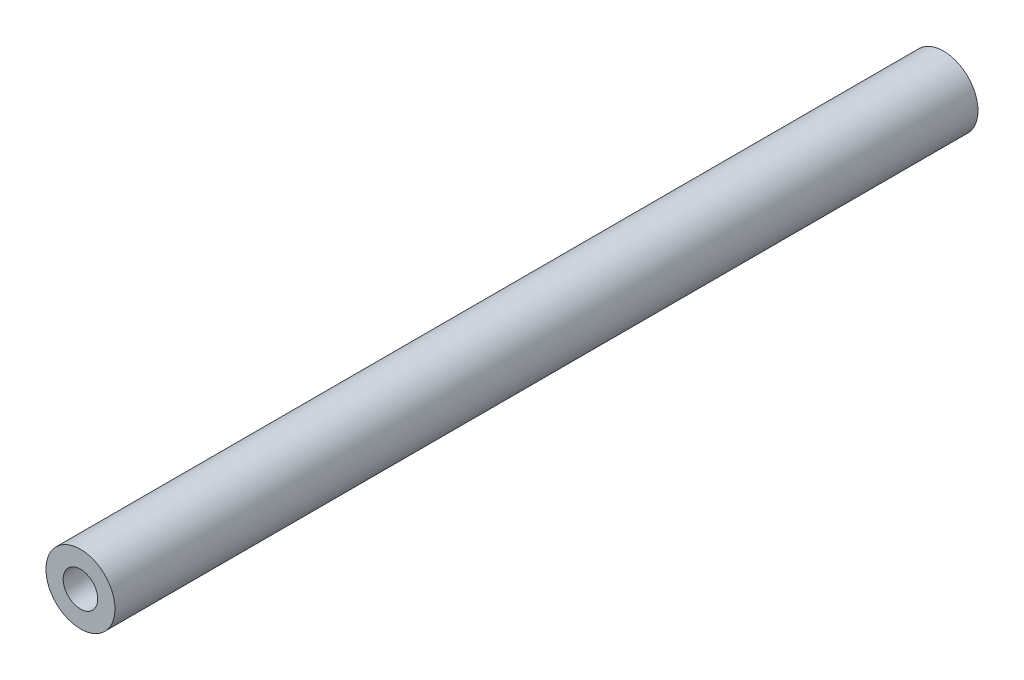
ISO-10303-21;
HEADER;
FILE_DESCRIPTION(('STEP AP214'),'2;1');
FILE_NAME('part.step','',(''),(''),'','','');
FILE_SCHEMA(('AUTOMOTIVE_DESIGN { 1 0 10303 214 1 1 1 1 }'));
ENDSEC;
DATA;
#1=APPLICATION_CONTEXT('core data for automotive mechanical design processes');
#2=APPLICATION_PROTOCOL_DEFINITION('international standard','automotive_design',2000,#1);
#3=PRODUCT_CONTEXT('',#1,'mechanical');
#4=PRODUCT('Part','Part','',(#3));
#5=PRODUCT_RELATED_PRODUCT_CATEGORY('part','',(#4));
#6=PRODUCT_DEFINITION_FORMATION('','',#4);
#7=PRODUCT_DEFINITION_CONTEXT('part definition',#1,'design');
#8=PRODUCT_DEFINITION('design','',#6,#7);
#9=PRODUCT_DEFINITION_SHAPE('','',#8);
#10=(LENGTH_UNIT() NAMED_UNIT(*) SI_UNIT(.MILLI.,.METRE.));
#11=(NAMED_UNIT(*) PLANE_ANGLE_UNIT() SI_UNIT($,.RADIAN.));
#12=(NAMED_UNIT(*) SI_UNIT($,.STERADIAN.) SOLID_ANGLE_UNIT());
#13=UNCERTAINTY_MEASURE_WITH_UNIT(LENGTH_MEASURE(1.E-05),#10,'distance_accuracy_value','');
#14=(GEOMETRIC_REPRESENTATION_CONTEXT(3) GLOBAL_UNCERTAINTY_ASSIGNED_CONTEXT((#13)) GLOBAL_UNIT_ASSIGNED_CONTEXT((#10,
#11,#12)) REPRESENTATION_CONTEXT('',''));
#15=CARTESIAN_POINT('',(0.,0.,0.));
#16=DIRECTION('',(0.,0.,1.));
#17=DIRECTION('',(1.,0.,0.));
#18=AXIS2_PLACEMENT_3D('',#15,#16,#17);
#19=CARTESIAN_POINT('',(0.,0.,50.));
#20=DIRECTION('',(0.,0.,1.));
#21=DIRECTION('',(1.,0.,0.));
#22=AXIS2_PLACEMENT_3D('',#19,#20,#21);
#23=PLANE('',#22);
#24=CARTESIAN_POINT('',(0.,0.,50.));
#25=DIRECTION('',(0.,0.,1.));
#26=DIRECTION('',(1.,0.,0.));
#27=AXIS2_PLACEMENT_3D('',#24,#25,#26);
#28=CIRCLE('',#27,2.);
#29=CARTESIAN_POINT('',(2.,0.,50.));
#30=VERTEX_POINT('',#29);
#31=EDGE_CURVE('E10',#30,#30,#28,.T.);
#32=ORIENTED_EDGE('',*,*,#31,.T.);
#33=EDGE_LOOP('',(#32));
#34=FACE_BOUND('',#33,.T.);
#35=CARTESIAN_POINT('',(0.,0.,50.));
#36=DIRECTION('',(0.,0.,1.));
#37=DIRECTION('',(1.,0.,0.));
#38=AXIS2_PLACEMENT_3D('',#35,#36,#37);
#39=CIRCLE('',#38,1.);
#40=CARTESIAN_POINT('',(1.,0.,50.));
#41=VERTEX_POINT('',#40);
#42=EDGE_CURVE('E54',#41,#41,#39,.T.);
#43=ORIENTED_EDGE('',*,*,#42,.F.);
#44=EDGE_LOOP('',(#43));
#45=FACE_BOUND('',#44,.T.);
#46=ADVANCED_FACE('F41',(#34,#45),#23,.T.);
#47=CARTESIAN_POINT('',(0.,0.,0.));
#48=DIRECTION('',(0.,0.,1.));
#49=DIRECTION('',(1.,0.,0.));
#50=AXIS2_PLACEMENT_3D('',#47,#48,#49);
#51=PLANE('',#50);
#52=CARTESIAN_POINT('',(0.,0.,0.));
#53=DIRECTION('',(0.,0.,1.));
#54=DIRECTION('',(1.,0.,0.));
#55=AXIS2_PLACEMENT_3D('',#52,#53,#54);
#56=CIRCLE('',#55,2.);
#57=CARTESIAN_POINT('',(2.,0.,0.));
#58=VERTEX_POINT('',#57);
#59=EDGE_CURVE('E45',#58,#58,#56,.T.);
#60=ORIENTED_EDGE('',*,*,#59,.F.);
#61=EDGE_LOOP('',(#60));
#62=FACE_BOUND('',#61,.T.);
#63=CARTESIAN_POINT('',(0.,0.,0.));
#64=DIRECTION('',(0.,0.,1.));
#65=DIRECTION('',(1.,0.,0.));
#66=AXIS2_PLACEMENT_3D('',#63,#64,#65);
#67=CIRCLE('',#66,1.);
#68=CARTESIAN_POINT('',(1.,0.,0.));
#69=VERTEX_POINT('',#68);
#70=EDGE_CURVE('E56',#69,#69,#67,.T.);
#71=ORIENTED_EDGE('',*,*,#70,.T.);
#72=EDGE_LOOP('',(#71));
#73=FACE_BOUND('',#72,.T.);
#74=ADVANCED_FACE('F68',(#62,#73),#51,.F.);
#75=CARTESIAN_POINT('',(0.,0.,50.));
#76=DIRECTION('',(0.,0.,-1.));
#77=DIRECTION('',(-1.,0.,0.));
#78=AXIS2_PLACEMENT_3D('',#75,#76,#77);
#79=CYLINDRICAL_SURFACE('',#78,2.);
#80=ORIENTED_EDGE('',*,*,#31,.F.);
#81=EDGE_LOOP('',(#80));
#82=FACE_BOUND('',#81,.T.);
#83=ORIENTED_EDGE('',*,*,#59,.T.);
#84=EDGE_LOOP('',(#83));
#85=FACE_BOUND('',#84,.T.);
#86=ADVANCED_FACE('F43',(#82,#85),#79,.T.);
#87=CARTESIAN_POINT('',(0.,0.,50.));
#88=DIRECTION('',(0.,0.,-1.));
#89=DIRECTION('',(-1.,0.,0.));
#90=AXIS2_PLACEMENT_3D('',#87,#88,#89);
#91=CYLINDRICAL_SURFACE('',#90,1.);
#92=ORIENTED_EDGE('',*,*,#42,.T.);
#93=EDGE_LOOP('',(#92));
#94=FACE_BOUND('',#93,.T.);
#95=ORIENTED_EDGE('',*,*,#70,.F.);
#96=EDGE_LOOP('',(#95));
#97=FACE_BOUND('',#96,.T.);
#98=ADVANCED_FACE('F64',(#94,#97),#91,.F.);
#99=CLOSED_SHELL('',(#46,#74,#86,#98));
#100=MANIFOLD_SOLID_BREP('B2',#99);
#101=ADVANCED_BREP_SHAPE_REPRESENTATION('',(#18,#100),#14);
#102=SHAPE_DEFINITION_REPRESENTATION(#9,#101);
ENDSEC;
END-ISO-10303-21;
